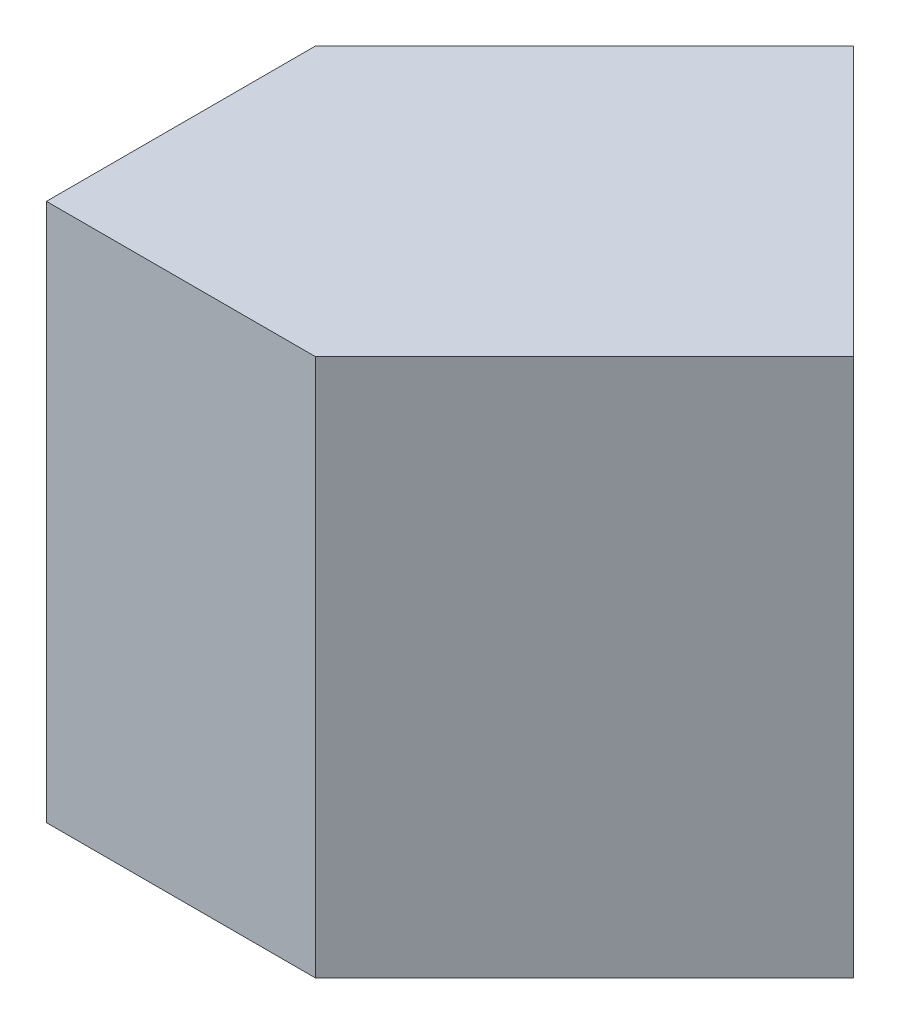
ISO-10303-21;
HEADER;
FILE_DESCRIPTION(('STEP AP214'),'2;1');
FILE_NAME('part.step','',(''),(''),'','','');
FILE_SCHEMA(('AUTOMOTIVE_DESIGN { 1 0 10303 214 1 1 1 1 }'));
ENDSEC;
DATA;
#1=APPLICATION_CONTEXT('core data for automotive mechanical design processes');
#2=APPLICATION_PROTOCOL_DEFINITION('international standard','automotive_design',2000,#1);
#3=PRODUCT_CONTEXT('',#1,'mechanical');
#4=PRODUCT('Part','Part','',(#3));
#5=PRODUCT_RELATED_PRODUCT_CATEGORY('part','',(#4));
#6=PRODUCT_DEFINITION_FORMATION('','',#4);
#7=PRODUCT_DEFINITION_CONTEXT('part definition',#1,'design');
#8=PRODUCT_DEFINITION('design','',#6,#7);
#9=PRODUCT_DEFINITION_SHAPE('','',#8);
#10=(LENGTH_UNIT() NAMED_UNIT(*) SI_UNIT(.MILLI.,.METRE.));
#11=(NAMED_UNIT(*) PLANE_ANGLE_UNIT() SI_UNIT($,.RADIAN.));
#12=(NAMED_UNIT(*) SI_UNIT($,.STERADIAN.) SOLID_ANGLE_UNIT());
#13=UNCERTAINTY_MEASURE_WITH_UNIT(LENGTH_MEASURE(1.E-05),#10,'distance_accuracy_value','');
#14=(GEOMETRIC_REPRESENTATION_CONTEXT(3) GLOBAL_UNCERTAINTY_ASSIGNED_CONTEXT((#13)) GLOBAL_UNIT_ASSIGNED_CONTEXT((#10,
#11,#12)) REPRESENTATION_CONTEXT('',''));
#15=CARTESIAN_POINT('',(0.,0.,0.));
#16=DIRECTION('',(0.,0.,1.));
#17=DIRECTION('',(1.,0.,0.));
#18=AXIS2_PLACEMENT_3D('',#15,#16,#17);
#19=CARTESIAN_POINT('',(0.,0.,20.));
#20=DIRECTION('',(1.,0.,0.));
#21=DIRECTION('',(0.,0.,-1.));
#22=AXIS2_PLACEMENT_3D('',#19,#20,#21);
#23=PLANE('',#22);
#24=DIRECTION('',(0.,0.,-1.));
#25=VECTOR('',#24,1.);
#26=CARTESIAN_POINT('',(0.,20.,20.));
#27=LINE('',#26,#25);
#28=CARTESIAN_POINT('',(0.,20.,20.));
#29=VERTEX_POINT('',#28);
#30=CARTESIAN_POINT('',(0.,20.,10.));
#31=VERTEX_POINT('',#30);
#32=EDGE_CURVE('E40',#29,#31,#27,.T.);
#33=ORIENTED_EDGE('',*,*,#32,.T.);
#34=DIRECTION('',(0.,1.,0.));
#35=VECTOR('',#34,1.);
#36=CARTESIAN_POINT('',(0.,0.,10.));
#37=LINE('',#36,#35);
#38=CARTESIAN_POINT('',(0.,0.,10.));
#39=VERTEX_POINT('',#38);
#40=EDGE_CURVE('E83',#39,#31,#37,.T.);
#41=ORIENTED_EDGE('',*,*,#40,.F.);
#42=DIRECTION('',(0.,0.,-1.));
#43=VECTOR('',#42,1.);
#44=CARTESIAN_POINT('',(0.,0.,20.));
#45=LINE('',#44,#43);
#46=CARTESIAN_POINT('',(0.,0.,20.));
#47=VERTEX_POINT('',#46);
#48=EDGE_CURVE('E11',#47,#39,#45,.T.);
#49=ORIENTED_EDGE('',*,*,#48,.F.);
#50=DIRECTION('',(0.,-1.,0.));
#51=VECTOR('',#50,1.);
#52=CARTESIAN_POINT('',(0.,0.,20.));
#53=LINE('',#52,#51);
#54=EDGE_CURVE('E170',#29,#47,#53,.T.);
#55=ORIENTED_EDGE('',*,*,#54,.F.);
#56=EDGE_LOOP('',(#33,#41,#49,#55));
#57=FACE_BOUND('',#56,.T.);
#58=ADVANCED_FACE('F33',(#57),#23,.F.);
#59=CARTESIAN_POINT('',(0.,0.,20.));
#60=DIRECTION('',(0.,1.,0.));
#61=DIRECTION('',(0.,0.,1.));
#62=AXIS2_PLACEMENT_3D('',#59,#60,#61);
#63=PLANE('',#62);
#64=ORIENTED_EDGE('',*,*,#48,.T.);
#65=DIRECTION('',(0.707106781186548,0.,-0.707106781186548));
#66=VECTOR('',#65,1.);
#67=CARTESIAN_POINT('',(10.,0.,0.));
#68=LINE('',#67,#66);
#69=CARTESIAN_POINT('',(10.,0.,0.));
#70=VERTEX_POINT('',#69);
#71=EDGE_CURVE('E80',#39,#70,#68,.T.);
#72=ORIENTED_EDGE('',*,*,#71,.T.);
#73=DIRECTION('',(0.707106781186548,0.,0.707106781186548));
#74=VECTOR('',#73,1.);
#75=CARTESIAN_POINT('',(10.,0.,0.));
#76=LINE('',#75,#74);
#77=CARTESIAN_POINT('',(20.,0.,10.));
#78=VERTEX_POINT('',#77);
#79=EDGE_CURVE('E175',#70,#78,#76,.T.);
#80=ORIENTED_EDGE('',*,*,#79,.T.);
#81=DIRECTION('',(-0.707106781186548,0.,0.707106781186548));
#82=VECTOR('',#81,1.);
#83=CARTESIAN_POINT('',(20.,0.,10.));
#84=LINE('',#83,#82);
#85=CARTESIAN_POINT('',(10.,0.,20.));
#86=VERTEX_POINT('',#85);
#87=EDGE_CURVE('E165',#78,#86,#84,.T.);
#88=ORIENTED_EDGE('',*,*,#87,.T.);
#89=DIRECTION('',(1.,0.,0.));
#90=VECTOR('',#89,1.);
#91=CARTESIAN_POINT('',(0.,0.,20.));
#92=LINE('',#91,#90);
#93=EDGE_CURVE('E54',#47,#86,#92,.T.);
#94=ORIENTED_EDGE('',*,*,#93,.F.);
#95=EDGE_LOOP('',(#64,#72,#80,#88,#94));
#96=FACE_BOUND('',#95,.T.);
#97=ADVANCED_FACE('F97',(#96),#63,.F.);
#98=CARTESIAN_POINT('',(0.,20.,20.));
#99=DIRECTION('',(0.,-1.,0.));
#100=DIRECTION('',(0.,0.,-1.));
#101=AXIS2_PLACEMENT_3D('',#98,#99,#100);
#102=PLANE('',#101);
#103=DIRECTION('',(0.707106781186548,0.,0.707106781186548));
#104=VECTOR('',#103,1.);
#105=CARTESIAN_POINT('',(10.,20.,0.));
#106=LINE('',#105,#104);
#107=CARTESIAN_POINT('',(10.,20.,0.));
#108=VERTEX_POINT('',#107);
#109=CARTESIAN_POINT('',(20.,20.,10.));
#110=VERTEX_POINT('',#109);
#111=EDGE_CURVE('E167',#108,#110,#106,.T.);
#112=ORIENTED_EDGE('',*,*,#111,.F.);
#113=DIRECTION('',(0.707106781186548,0.,-0.707106781186548));
#114=VECTOR('',#113,1.);
#115=CARTESIAN_POINT('',(10.,20.,0.));
#116=LINE('',#115,#114);
#117=EDGE_CURVE('E89',#31,#108,#116,.T.);
#118=ORIENTED_EDGE('',*,*,#117,.F.);
#119=ORIENTED_EDGE('',*,*,#32,.F.);
#120=DIRECTION('',(-1.,0.,0.));
#121=VECTOR('',#120,1.);
#122=CARTESIAN_POINT('',(0.,20.,20.));
#123=LINE('',#122,#121);
#124=CARTESIAN_POINT('',(10.,20.,20.));
#125=VERTEX_POINT('',#124);
#126=EDGE_CURVE('E47',#125,#29,#123,.T.);
#127=ORIENTED_EDGE('',*,*,#126,.F.);
#128=DIRECTION('',(-0.707106781186548,0.,0.707106781186548));
#129=VECTOR('',#128,1.);
#130=CARTESIAN_POINT('',(20.,20.,10.));
#131=LINE('',#130,#129);
#132=EDGE_CURVE('E95',#110,#125,#131,.T.);
#133=ORIENTED_EDGE('',*,*,#132,.F.);
#134=EDGE_LOOP('',(#112,#118,#119,#127,#133));
#135=FACE_BOUND('',#134,.T.);
#136=ADVANCED_FACE('F99',(#135),#102,.F.);
#137=CARTESIAN_POINT('',(0.,0.,20.));
#138=DIRECTION('',(0.,0.,-1.));
#139=DIRECTION('',(-1.,0.,0.));
#140=AXIS2_PLACEMENT_3D('',#137,#138,#139);
#141=PLANE('',#140);
#142=ORIENTED_EDGE('',*,*,#93,.T.);
#143=DIRECTION('',(0.,1.,0.));
#144=VECTOR('',#143,1.);
#145=CARTESIAN_POINT('',(10.,0.,20.));
#146=LINE('',#145,#144);
#147=EDGE_CURVE('E160',#86,#125,#146,.T.);
#148=ORIENTED_EDGE('',*,*,#147,.T.);
#149=ORIENTED_EDGE('',*,*,#126,.T.);
#150=ORIENTED_EDGE('',*,*,#54,.T.);
#151=EDGE_LOOP('',(#142,#148,#149,#150));
#152=FACE_BOUND('',#151,.T.);
#153=ADVANCED_FACE('F104',(#152),#141,.F.);
#154=CARTESIAN_POINT('',(10.,0.,0.));
#155=DIRECTION('',(-0.707106781186548,0.,0.707106781186548));
#156=DIRECTION('',(0.707106781186548,0.,0.707106781186548));
#157=AXIS2_PLACEMENT_3D('',#154,#155,#156);
#158=PLANE('',#157);
#159=ORIENTED_EDGE('',*,*,#111,.T.);
#160=DIRECTION('',(0.,1.,0.));
#161=VECTOR('',#160,1.);
#162=CARTESIAN_POINT('',(20.,0.,10.));
#163=LINE('',#162,#161);
#164=EDGE_CURVE('E162',#78,#110,#163,.T.);
#165=ORIENTED_EDGE('',*,*,#164,.F.);
#166=ORIENTED_EDGE('',*,*,#79,.F.);
#167=DIRECTION('',(0.,1.,0.));
#168=VECTOR('',#167,1.);
#169=CARTESIAN_POINT('',(10.,0.,0.));
#170=LINE('',#169,#168);
#171=EDGE_CURVE('E86',#70,#108,#170,.T.);
#172=ORIENTED_EDGE('',*,*,#171,.T.);
#173=EDGE_LOOP('',(#159,#165,#166,#172));
#174=FACE_BOUND('',#173,.T.);
#175=ADVANCED_FACE('F110',(#174),#158,.F.);
#176=CARTESIAN_POINT('',(20.,0.,10.));
#177=DIRECTION('',(-0.707106781186548,0.,-0.707106781186548));
#178=DIRECTION('',(-0.707106781186548,0.,0.707106781186548));
#179=AXIS2_PLACEMENT_3D('',#176,#177,#178);
#180=PLANE('',#179);
#181=ORIENTED_EDGE('',*,*,#132,.T.);
#182=ORIENTED_EDGE('',*,*,#147,.F.);
#183=ORIENTED_EDGE('',*,*,#87,.F.);
#184=ORIENTED_EDGE('',*,*,#164,.T.);
#185=EDGE_LOOP('',(#181,#182,#183,#184));
#186=FACE_BOUND('',#185,.T.);
#187=ADVANCED_FACE('F113',(#186),#180,.F.);
#188=CARTESIAN_POINT('',(10.,0.,0.));
#189=DIRECTION('',(0.707106781186548,0.,0.707106781186548));
#190=DIRECTION('',(0.707106781186548,0.,-0.707106781186548));
#191=AXIS2_PLACEMENT_3D('',#188,#189,#190);
#192=PLANE('',#191);
#193=ORIENTED_EDGE('',*,*,#117,.T.);
#194=ORIENTED_EDGE('',*,*,#171,.F.);
#195=ORIENTED_EDGE('',*,*,#71,.F.);
#196=ORIENTED_EDGE('',*,*,#40,.T.);
#197=EDGE_LOOP('',(#193,#194,#195,#196));
#198=FACE_BOUND('',#197,.T.);
#199=ADVANCED_FACE('F82',(#198),#192,.F.);
#200=CLOSED_SHELL('',(#58,#97,#136,#153,#175,#187,#199));
#201=MANIFOLD_SOLID_BREP('B2',#200);
#202=ADVANCED_BREP_SHAPE_REPRESENTATION('',(#18,#201),#14);
#203=SHAPE_DEFINITION_REPRESENTATION(#9,#202);
ENDSEC;
END-ISO-10303-21;
